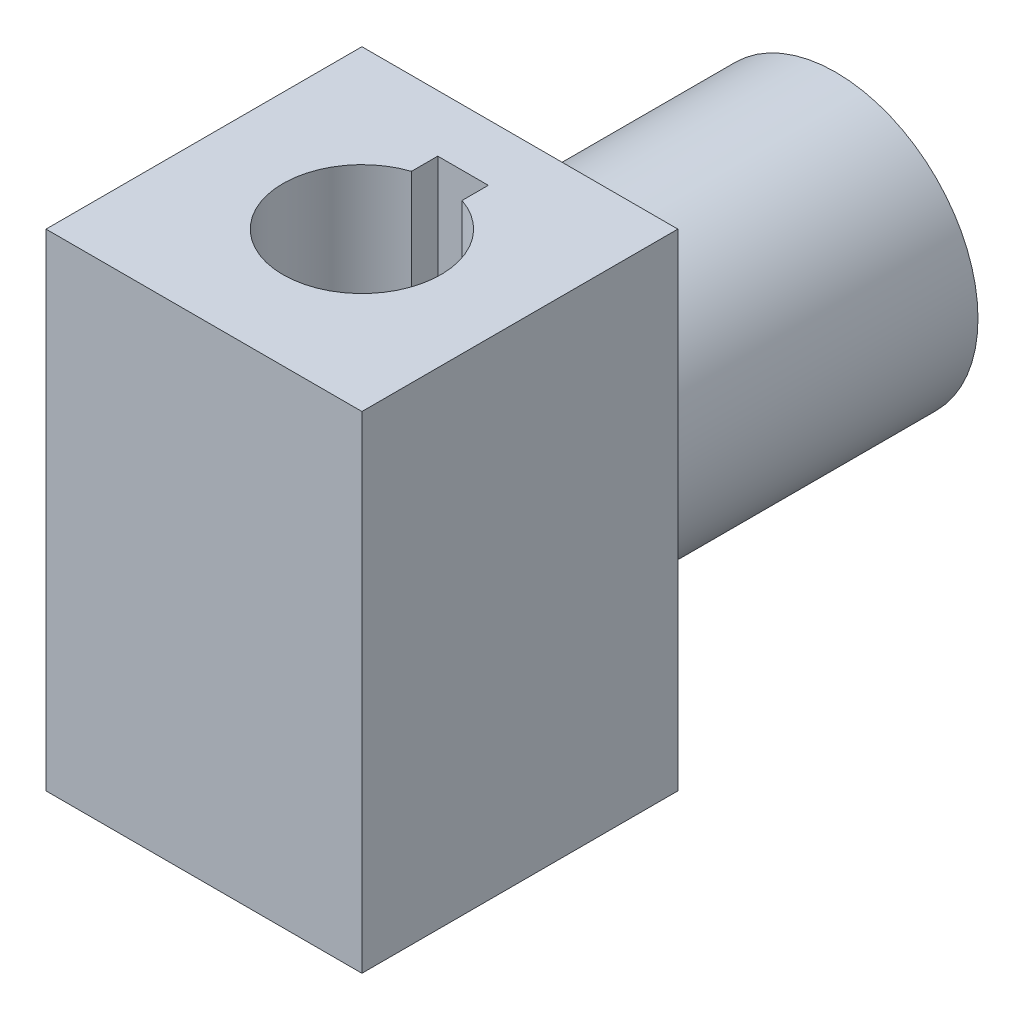
ISO-10303-21;
HEADER;
FILE_DESCRIPTION(('STEP AP214'),'2;1');
FILE_NAME('part.step','',(''),(''),'','','');
FILE_SCHEMA(('AUTOMOTIVE_DESIGN { 1 0 10303 214 1 1 1 1 }'));
ENDSEC;
DATA;
#1=APPLICATION_CONTEXT('core data for automotive mechanical design processes');
#2=APPLICATION_PROTOCOL_DEFINITION('international standard','automotive_design',2000,#1);
#3=PRODUCT_CONTEXT('',#1,'mechanical');
#4=PRODUCT('Part','Part','',(#3));
#5=PRODUCT_RELATED_PRODUCT_CATEGORY('part','',(#4));
#6=PRODUCT_DEFINITION_FORMATION('','',#4);
#7=PRODUCT_DEFINITION_CONTEXT('part definition',#1,'design');
#8=PRODUCT_DEFINITION('design','',#6,#7);
#9=PRODUCT_DEFINITION_SHAPE('','',#8);
#10=(LENGTH_UNIT() NAMED_UNIT(*) SI_UNIT(.MILLI.,.METRE.));
#11=(NAMED_UNIT(*) PLANE_ANGLE_UNIT() SI_UNIT($,.RADIAN.));
#12=(NAMED_UNIT(*) SI_UNIT($,.STERADIAN.) SOLID_ANGLE_UNIT());
#13=UNCERTAINTY_MEASURE_WITH_UNIT(LENGTH_MEASURE(1.E-05),#10,'distance_accuracy_value','');
#14=(GEOMETRIC_REPRESENTATION_CONTEXT(3) GLOBAL_UNCERTAINTY_ASSIGNED_CONTEXT((#13)) GLOBAL_UNIT_ASSIGNED_CONTEXT((#10,
#11,#12)) REPRESENTATION_CONTEXT('',''));
#15=CARTESIAN_POINT('',(0.,0.,0.));
#16=DIRECTION('',(0.,0.,1.));
#17=DIRECTION('',(1.,0.,0.));
#18=AXIS2_PLACEMENT_3D('',#15,#16,#17);
#19=CARTESIAN_POINT('',(0.,77.,25.));
#20=DIRECTION('',(0.,0.,-1.));
#21=DIRECTION('',(-1.,0.,0.));
#22=AXIS2_PLACEMENT_3D('',#19,#20,#21);
#23=PLANE('',#22);
#24=DIRECTION('',(1.,0.,0.));
#25=VECTOR('',#24,1.);
#26=CARTESIAN_POINT('',(0.,0.,25.));
#27=LINE('',#26,#25);
#28=CARTESIAN_POINT('',(-25.,0.,25.));
#29=VERTEX_POINT('',#28);
#30=CARTESIAN_POINT('',(25.,0.,25.));
#31=VERTEX_POINT('',#30);
#32=EDGE_CURVE('E161',#29,#31,#27,.T.);
#33=ORIENTED_EDGE('',*,*,#32,.T.);
#34=DIRECTION('',(0.,-1.,0.));
#35=VECTOR('',#34,1.);
#36=CARTESIAN_POINT('',(25.,77.,25.));
#37=LINE('',#36,#35);
#38=CARTESIAN_POINT('',(25.,77.,25.));
#39=VERTEX_POINT('',#38);
#40=EDGE_CURVE('E52',#39,#31,#37,.T.);
#41=ORIENTED_EDGE('',*,*,#40,.F.);
#42=DIRECTION('',(1.,0.,0.));
#43=VECTOR('',#42,1.);
#44=CARTESIAN_POINT('',(0.,77.,25.));
#45=LINE('',#44,#43);
#46=CARTESIAN_POINT('',(-25.,77.,25.));
#47=VERTEX_POINT('',#46);
#48=EDGE_CURVE('E121',#47,#39,#45,.T.);
#49=ORIENTED_EDGE('',*,*,#48,.F.);
#50=DIRECTION('',(0.,-1.,0.));
#51=VECTOR('',#50,1.);
#52=CARTESIAN_POINT('',(-25.,77.,25.));
#53=LINE('',#52,#51);
#54=EDGE_CURVE('E61',#47,#29,#53,.T.);
#55=ORIENTED_EDGE('',*,*,#54,.T.);
#56=EDGE_LOOP('',(#33,#41,#49,#55));
#57=FACE_BOUND('',#56,.T.);
#58=ADVANCED_FACE('F41',(#57),#23,.F.);
#59=CARTESIAN_POINT('',(25.,77.,0.));
#60=DIRECTION('',(-1.,0.,0.));
#61=DIRECTION('',(0.,0.,1.));
#62=AXIS2_PLACEMENT_3D('',#59,#60,#61);
#63=PLANE('',#62);
#64=DIRECTION('',(0.,0.,-1.));
#65=VECTOR('',#64,1.);
#66=CARTESIAN_POINT('',(25.,0.,0.));
#67=LINE('',#66,#65);
#68=CARTESIAN_POINT('',(25.,0.,-25.));
#69=VERTEX_POINT('',#68);
#70=EDGE_CURVE('E130',#31,#69,#67,.T.);
#71=ORIENTED_EDGE('',*,*,#70,.T.);
#72=DIRECTION('',(0.,-1.,0.));
#73=VECTOR('',#72,1.);
#74=CARTESIAN_POINT('',(25.,77.,-25.));
#75=LINE('',#74,#73);
#76=CARTESIAN_POINT('',(25.,77.,-25.));
#77=VERTEX_POINT('',#76);
#78=EDGE_CURVE('E128',#77,#69,#75,.T.);
#79=ORIENTED_EDGE('',*,*,#78,.F.);
#80=DIRECTION('',(0.,0.,-1.));
#81=VECTOR('',#80,1.);
#82=CARTESIAN_POINT('',(25.,77.,0.));
#83=LINE('',#82,#81);
#84=EDGE_CURVE('E115',#39,#77,#83,.T.);
#85=ORIENTED_EDGE('',*,*,#84,.F.);
#86=ORIENTED_EDGE('',*,*,#40,.T.);
#87=EDGE_LOOP('',(#71,#79,#85,#86));
#88=FACE_BOUND('',#87,.T.);
#89=ADVANCED_FACE('F129',(#88),#63,.F.);
#90=CARTESIAN_POINT('',(0.,77.,-25.));
#91=DIRECTION('',(0.,0.,-1.));
#92=DIRECTION('',(-1.,0.,0.));
#93=AXIS2_PLACEMENT_3D('',#90,#91,#92);
#94=PLANE('',#93);
#95=CARTESIAN_POINT('',(0.,38.5,-25.));
#96=DIRECTION('',(0.,0.,-1.));
#97=DIRECTION('',(-1.,0.,0.));
#98=AXIS2_PLACEMENT_3D('',#95,#96,#97);
#99=CIRCLE('',#98,22.5);
#100=CARTESIAN_POINT('',(-22.5,38.5,-25.));
#101=VERTEX_POINT('',#100);
#102=EDGE_CURVE('E11',#101,#101,#99,.T.);
#103=ORIENTED_EDGE('',*,*,#102,.F.);
#104=EDGE_LOOP('',(#103));
#105=FACE_BOUND('',#104,.T.);
#106=DIRECTION('',(1.,0.,0.));
#107=VECTOR('',#106,1.);
#108=CARTESIAN_POINT('',(0.,0.,-25.));
#109=LINE('',#108,#107);
#110=CARTESIAN_POINT('',(-25.,0.,-25.));
#111=VERTEX_POINT('',#110);
#112=EDGE_CURVE('E166',#111,#69,#109,.T.);
#113=ORIENTED_EDGE('',*,*,#112,.F.);
#114=DIRECTION('',(0.,-1.,0.));
#115=VECTOR('',#114,1.);
#116=CARTESIAN_POINT('',(-25.,77.,-25.));
#117=LINE('',#116,#115);
#118=CARTESIAN_POINT('',(-25.,77.,-25.));
#119=VERTEX_POINT('',#118);
#120=EDGE_CURVE('E87',#119,#111,#117,.T.);
#121=ORIENTED_EDGE('',*,*,#120,.F.);
#122=DIRECTION('',(1.,0.,0.));
#123=VECTOR('',#122,1.);
#124=CARTESIAN_POINT('',(0.,77.,-25.));
#125=LINE('',#124,#123);
#126=EDGE_CURVE('E120',#119,#77,#125,.T.);
#127=ORIENTED_EDGE('',*,*,#126,.T.);
#128=ORIENTED_EDGE('',*,*,#78,.T.);
#129=EDGE_LOOP('',(#113,#121,#127,#128));
#130=FACE_BOUND('',#129,.T.);
#131=ADVANCED_FACE('F135',(#105,#130),#94,.T.);
#132=CARTESIAN_POINT('',(0.,77.,0.));
#133=DIRECTION('',(0.,-1.,0.));
#134=DIRECTION('',(0.,0.,-1.));
#135=AXIS2_PLACEMENT_3D('',#132,#133,#134);
#136=CYLINDRICAL_SURFACE('',#135,12.5);
#137=CARTESIAN_POINT('',(0.,0.,0.));
#138=DIRECTION('',(0.,1.,0.));
#139=DIRECTION('',(0.,0.,1.));
#140=AXIS2_PLACEMENT_3D('',#137,#138,#139);
#141=CIRCLE('',#140,12.5);
#142=CARTESIAN_POINT('',(-4.,0.,-11.842719282327));
#143=VERTEX_POINT('',#142);
#144=CARTESIAN_POINT('',(4.,0.,-11.842719282327));
#145=VERTEX_POINT('',#144);
#146=EDGE_CURVE('E144',#143,#145,#141,.T.);
#147=ORIENTED_EDGE('',*,*,#146,.F.);
#148=DIRECTION('',(0.,-1.,0.));
#149=VECTOR('',#148,1.);
#150=CARTESIAN_POINT('',(-4.,77.,-11.842719282327));
#151=LINE('',#150,#149);
#152=CARTESIAN_POINT('',(-4.,77.,-11.842719282327));
#153=VERTEX_POINT('',#152);
#154=EDGE_CURVE('E45',#153,#143,#151,.T.);
#155=ORIENTED_EDGE('',*,*,#154,.F.);
#156=CARTESIAN_POINT('',(0.,77.,0.));
#157=DIRECTION('',(0.,1.,0.));
#158=DIRECTION('',(0.,0.,1.));
#159=AXIS2_PLACEMENT_3D('',#156,#157,#158);
#160=CIRCLE('',#159,12.5);
#161=CARTESIAN_POINT('',(4.,77.,-11.842719282327));
#162=VERTEX_POINT('',#161);
#163=EDGE_CURVE('E173',#153,#162,#160,.T.);
#164=ORIENTED_EDGE('',*,*,#163,.T.);
#165=DIRECTION('',(0.,-1.,0.));
#166=VECTOR('',#165,1.);
#167=CARTESIAN_POINT('',(4.,77.,-11.842719282327));
#168=LINE('',#167,#166);
#169=EDGE_CURVE('E140',#162,#145,#168,.T.);
#170=ORIENTED_EDGE('',*,*,#169,.T.);
#171=EDGE_LOOP('',(#147,#155,#164,#170));
#172=FACE_BOUND('',#171,.T.);
#173=ADVANCED_FACE('F43',(#172),#136,.F.);
#174=CARTESIAN_POINT('',(-4.,77.,0.));
#175=DIRECTION('',(-1.,0.,0.));
#176=DIRECTION('',(0.,0.,1.));
#177=AXIS2_PLACEMENT_3D('',#174,#175,#176);
#178=PLANE('',#177);
#179=DIRECTION('',(0.,0.,-1.));
#180=VECTOR('',#179,1.);
#181=CARTESIAN_POINT('',(-4.,0.,0.));
#182=LINE('',#181,#180);
#183=CARTESIAN_POINT('',(-4.,0.,-16.));
#184=VERTEX_POINT('',#183);
#185=EDGE_CURVE('E148',#143,#184,#182,.T.);
#186=ORIENTED_EDGE('',*,*,#185,.T.);
#187=DIRECTION('',(0.,-1.,0.));
#188=VECTOR('',#187,1.);
#189=CARTESIAN_POINT('',(-4.,77.,-16.));
#190=LINE('',#189,#188);
#191=CARTESIAN_POINT('',(-4.,77.,-16.));
#192=VERTEX_POINT('',#191);
#193=EDGE_CURVE('E184',#192,#184,#190,.T.);
#194=ORIENTED_EDGE('',*,*,#193,.F.);
#195=DIRECTION('',(0.,0.,-1.));
#196=VECTOR('',#195,1.);
#197=CARTESIAN_POINT('',(-4.,77.,0.));
#198=LINE('',#197,#196);
#199=EDGE_CURVE('E194',#153,#192,#198,.T.);
#200=ORIENTED_EDGE('',*,*,#199,.F.);
#201=ORIENTED_EDGE('',*,*,#154,.T.);
#202=EDGE_LOOP('',(#186,#194,#200,#201));
#203=FACE_BOUND('',#202,.T.);
#204=ADVANCED_FACE('F193',(#203),#178,.F.);
#205=CARTESIAN_POINT('',(0.,77.,-16.));
#206=DIRECTION('',(0.,0.,1.));
#207=DIRECTION('',(1.,0.,0.));
#208=AXIS2_PLACEMENT_3D('',#205,#206,#207);
#209=PLANE('',#208);
#210=DIRECTION('',(-1.,0.,0.));
#211=VECTOR('',#210,1.);
#212=CARTESIAN_POINT('',(0.,0.,-16.));
#213=LINE('',#212,#211);
#214=CARTESIAN_POINT('',(4.,0.,-16.));
#215=VERTEX_POINT('',#214);
#216=EDGE_CURVE('E153',#215,#184,#213,.T.);
#217=ORIENTED_EDGE('',*,*,#216,.F.);
#218=DIRECTION('',(0.,-1.,0.));
#219=VECTOR('',#218,1.);
#220=CARTESIAN_POINT('',(4.,77.,-16.));
#221=LINE('',#220,#219);
#222=CARTESIAN_POINT('',(4.,77.,-16.));
#223=VERTEX_POINT('',#222);
#224=EDGE_CURVE('E182',#223,#215,#221,.T.);
#225=ORIENTED_EDGE('',*,*,#224,.F.);
#226=DIRECTION('',(-1.,0.,0.));
#227=VECTOR('',#226,1.);
#228=CARTESIAN_POINT('',(0.,77.,-16.));
#229=LINE('',#228,#227);
#230=EDGE_CURVE('E250',#223,#192,#229,.T.);
#231=ORIENTED_EDGE('',*,*,#230,.T.);
#232=ORIENTED_EDGE('',*,*,#193,.T.);
#233=EDGE_LOOP('',(#217,#225,#231,#232));
#234=FACE_BOUND('',#233,.T.);
#235=ADVANCED_FACE('F206',(#234),#209,.T.);
#236=CARTESIAN_POINT('',(4.,77.,0.));
#237=DIRECTION('',(-1.,0.,0.));
#238=DIRECTION('',(0.,0.,1.));
#239=AXIS2_PLACEMENT_3D('',#236,#237,#238);
#240=PLANE('',#239);
#241=DIRECTION('',(0.,0.,-1.));
#242=VECTOR('',#241,1.);
#243=CARTESIAN_POINT('',(4.,0.,0.));
#244=LINE('',#243,#242);
#245=EDGE_CURVE('E157',#145,#215,#244,.T.);
#246=ORIENTED_EDGE('',*,*,#245,.F.);
#247=ORIENTED_EDGE('',*,*,#169,.F.);
#248=DIRECTION('',(0.,0.,-1.));
#249=VECTOR('',#248,1.);
#250=CARTESIAN_POINT('',(4.,77.,0.));
#251=LINE('',#250,#249);
#252=EDGE_CURVE('E204',#162,#223,#251,.T.);
#253=ORIENTED_EDGE('',*,*,#252,.T.);
#254=ORIENTED_EDGE('',*,*,#224,.T.);
#255=EDGE_LOOP('',(#246,#247,#253,#254));
#256=FACE_BOUND('',#255,.T.);
#257=ADVANCED_FACE('F203',(#256),#240,.T.);
#258=CARTESIAN_POINT('',(-25.,77.,0.));
#259=DIRECTION('',(-1.,0.,0.));
#260=DIRECTION('',(0.,0.,1.));
#261=AXIS2_PLACEMENT_3D('',#258,#259,#260);
#262=PLANE('',#261);
#263=DIRECTION('',(0.,0.,-1.));
#264=VECTOR('',#263,1.);
#265=CARTESIAN_POINT('',(-25.,0.,0.));
#266=LINE('',#265,#264);
#267=EDGE_CURVE('E169',#29,#111,#266,.T.);
#268=ORIENTED_EDGE('',*,*,#267,.F.);
#269=ORIENTED_EDGE('',*,*,#54,.F.);
#270=DIRECTION('',(0.,0.,-1.));
#271=VECTOR('',#270,1.);
#272=CARTESIAN_POINT('',(-25.,77.,0.));
#273=LINE('',#272,#271);
#274=EDGE_CURVE('E137',#47,#119,#273,.T.);
#275=ORIENTED_EDGE('',*,*,#274,.T.);
#276=ORIENTED_EDGE('',*,*,#120,.T.);
#277=EDGE_LOOP('',(#268,#269,#275,#276));
#278=FACE_BOUND('',#277,.T.);
#279=ADVANCED_FACE('F213',(#278),#262,.T.);
#280=CARTESIAN_POINT('',(0.,77.,0.));
#281=DIRECTION('',(0.,1.,0.));
#282=DIRECTION('',(0.,0.,1.));
#283=AXIS2_PLACEMENT_3D('',#280,#281,#282);
#284=PLANE('',#283);
#285=ORIENTED_EDGE('',*,*,#163,.F.);
#286=ORIENTED_EDGE('',*,*,#199,.T.);
#287=ORIENTED_EDGE('',*,*,#230,.F.);
#288=ORIENTED_EDGE('',*,*,#252,.F.);
#289=EDGE_LOOP('',(#285,#286,#287,#288));
#290=FACE_BOUND('',#289,.T.);
#291=ORIENTED_EDGE('',*,*,#48,.T.);
#292=ORIENTED_EDGE('',*,*,#84,.T.);
#293=ORIENTED_EDGE('',*,*,#126,.F.);
#294=ORIENTED_EDGE('',*,*,#274,.F.);
#295=EDGE_LOOP('',(#291,#292,#293,#294));
#296=FACE_BOUND('',#295,.T.);
#297=ADVANCED_FACE('F117',(#290,#296),#284,.T.);
#298=CARTESIAN_POINT('',(0.,0.,0.));
#299=DIRECTION('',(0.,1.,0.));
#300=DIRECTION('',(0.,0.,1.));
#301=AXIS2_PLACEMENT_3D('',#298,#299,#300);
#302=PLANE('',#301);
#303=ORIENTED_EDGE('',*,*,#146,.T.);
#304=ORIENTED_EDGE('',*,*,#245,.T.);
#305=ORIENTED_EDGE('',*,*,#216,.T.);
#306=ORIENTED_EDGE('',*,*,#185,.F.);
#307=EDGE_LOOP('',(#303,#304,#305,#306));
#308=FACE_BOUND('',#307,.T.);
#309=ORIENTED_EDGE('',*,*,#32,.F.);
#310=ORIENTED_EDGE('',*,*,#267,.T.);
#311=ORIENTED_EDGE('',*,*,#112,.T.);
#312=ORIENTED_EDGE('',*,*,#70,.F.);
#313=EDGE_LOOP('',(#309,#310,#311,#312));
#314=FACE_BOUND('',#313,.T.);
#315=ADVANCED_FACE('F197',(#308,#314),#302,.F.);
#316=CARTESIAN_POINT('',(0.,38.5,-75.));
#317=DIRECTION('',(0.,0.,1.));
#318=DIRECTION('',(1.,0.,0.));
#319=AXIS2_PLACEMENT_3D('',#316,#317,#318);
#320=CYLINDRICAL_SURFACE('',#319,22.5);
#321=CARTESIAN_POINT('',(0.,38.5,-75.));
#322=DIRECTION('',(0.,0.,-1.));
#323=DIRECTION('',(-1.,0.,0.));
#324=AXIS2_PLACEMENT_3D('',#321,#322,#323);
#325=CIRCLE('',#324,22.5);
#326=CARTESIAN_POINT('',(-22.5,38.5,-75.));
#327=VERTEX_POINT('',#326);
#328=EDGE_CURVE('E149',#327,#327,#325,.T.);
#329=ORIENTED_EDGE('',*,*,#328,.F.);
#330=EDGE_LOOP('',(#329));
#331=FACE_BOUND('',#330,.T.);
#332=ORIENTED_EDGE('',*,*,#102,.T.);
#333=EDGE_LOOP('',(#332));
#334=FACE_BOUND('',#333,.T.);
#335=ADVANCED_FACE('F229',(#331,#334),#320,.T.);
#336=CARTESIAN_POINT('',(0.,38.5,-75.));
#337=DIRECTION('',(0.,0.,-1.));
#338=DIRECTION('',(-1.,0.,0.));
#339=AXIS2_PLACEMENT_3D('',#336,#337,#338);
#340=PLANE('',#339);
#341=ORIENTED_EDGE('',*,*,#328,.T.);
#342=EDGE_LOOP('',(#341));
#343=FACE_BOUND('',#342,.T.);
#344=ADVANCED_FACE('F235',(#343),#340,.T.);
#345=CLOSED_SHELL('',(#58,#89,#131,#173,#204,#235,#257,#279,#297,#315,#335,#344));
#346=MANIFOLD_SOLID_BREP('B2',#345);
#347=ADVANCED_BREP_SHAPE_REPRESENTATION('',(#18,#346),#14);
#348=SHAPE_DEFINITION_REPRESENTATION(#9,#347);
ENDSEC;
END-ISO-10303-21;
